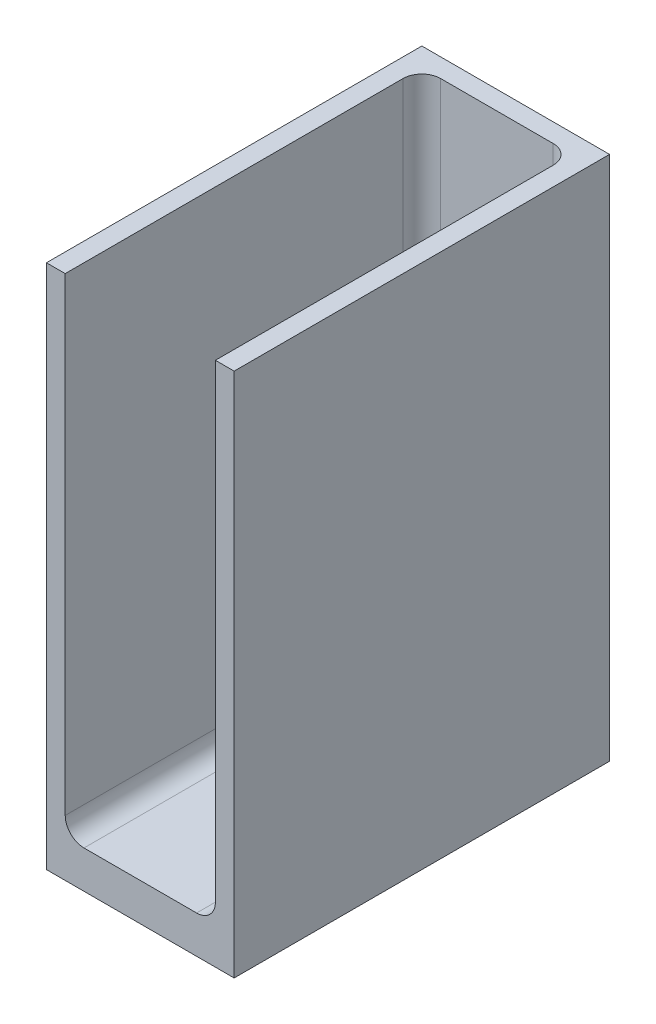
ISO-10303-21;
HEADER;
FILE_DESCRIPTION(('STEP AP214'),'2;1');
FILE_NAME('part.step','',(''),(''),'','','');
FILE_SCHEMA(('AUTOMOTIVE_DESIGN { 1 0 10303 214 1 1 1 1 }'));
ENDSEC;
DATA;
#1=APPLICATION_CONTEXT('core data for automotive mechanical design processes');
#2=APPLICATION_PROTOCOL_DEFINITION('international standard','automotive_design',2000,#1);
#3=PRODUCT_CONTEXT('',#1,'mechanical');
#4=PRODUCT('Part','Part','',(#3));
#5=PRODUCT_RELATED_PRODUCT_CATEGORY('part','',(#4));
#6=PRODUCT_DEFINITION_FORMATION('','',#4);
#7=PRODUCT_DEFINITION_CONTEXT('part definition',#1,'design');
#8=PRODUCT_DEFINITION('design','',#6,#7);
#9=PRODUCT_DEFINITION_SHAPE('','',#8);
#10=(LENGTH_UNIT() NAMED_UNIT(*) SI_UNIT(.MILLI.,.METRE.));
#11=(NAMED_UNIT(*) PLANE_ANGLE_UNIT() SI_UNIT($,.RADIAN.));
#12=(NAMED_UNIT(*) SI_UNIT($,.STERADIAN.) SOLID_ANGLE_UNIT());
#13=UNCERTAINTY_MEASURE_WITH_UNIT(LENGTH_MEASURE(1.E-05),#10,'distance_accuracy_value','');
#14=(GEOMETRIC_REPRESENTATION_CONTEXT(3) GLOBAL_UNCERTAINTY_ASSIGNED_CONTEXT((#13)) GLOBAL_UNIT_ASSIGNED_CONTEXT((#10,
#11,#12)) REPRESENTATION_CONTEXT('',''));
#15=CARTESIAN_POINT('',(0.,0.,0.));
#16=DIRECTION('',(0.,0.,1.));
#17=DIRECTION('',(1.,0.,0.));
#18=AXIS2_PLACEMENT_3D('',#15,#16,#17);
#19=CARTESIAN_POINT('',(0.,5.08,0.));
#20=DIRECTION('',(0.,-1.,0.));
#21=DIRECTION('',(0.,0.,-1.));
#22=AXIS2_PLACEMENT_3D('',#19,#20,#21);
#23=PLANE('',#22);
#24=DIRECTION('',(1.,0.,0.));
#25=VECTOR('',#24,1.);
#26=CARTESIAN_POINT('',(-12.7,5.08,25.4));
#27=LINE('',#26,#25);
#28=CARTESIAN_POINT('',(-7.62,5.08,25.4));
#29=VERTEX_POINT('',#28);
#30=CARTESIAN_POINT('',(7.62,5.08,25.4));
#31=VERTEX_POINT('',#30);
#32=EDGE_CURVE('E161',#29,#31,#27,.T.);
#33=ORIENTED_EDGE('',*,*,#32,.T.);
#34=DIRECTION('',(0.,0.,1.));
#35=VECTOR('',#34,1.);
#36=CARTESIAN_POINT('',(7.62,5.08,-22.86));
#37=LINE('',#36,#35);
#38=CARTESIAN_POINT('',(7.62,5.08,-20.32));
#39=VERTEX_POINT('',#38);
#40=EDGE_CURVE('E59',#31,#39,#37,.F.);
#41=ORIENTED_EDGE('',*,*,#40,.T.);
#42=DIRECTION('',(1.,0.,0.));
#43=VECTOR('',#42,1.);
#44=CARTESIAN_POINT('',(-10.16,5.08,-20.32));
#45=LINE('',#44,#43);
#46=CARTESIAN_POINT('',(-7.62,5.08,-20.32));
#47=VERTEX_POINT('',#46);
#48=EDGE_CURVE('E54',#39,#47,#45,.F.);
#49=ORIENTED_EDGE('',*,*,#48,.T.);
#50=DIRECTION('',(0.,0.,-1.));
#51=VECTOR('',#50,1.);
#52=CARTESIAN_POINT('',(-7.62,5.08,25.4));
#53=LINE('',#52,#51);
#54=EDGE_CURVE('E194',#47,#29,#53,.F.);
#55=ORIENTED_EDGE('',*,*,#54,.T.);
#56=EDGE_LOOP('',(#33,#41,#49,#55));
#57=FACE_BOUND('',#56,.T.);
#58=ADVANCED_FACE('F37',(#57),#23,.F.);
#59=CARTESIAN_POINT('',(12.7,5.08,25.4));
#60=DIRECTION('',(-1.,0.,0.));
#61=DIRECTION('',(0.,0.,1.));
#62=AXIS2_PLACEMENT_3D('',#59,#60,#61);
#63=PLANE('',#62);
#64=DIRECTION('',(0.,0.,-1.));
#65=VECTOR('',#64,1.);
#66=CARTESIAN_POINT('',(12.7,0.,25.4));
#67=LINE('',#66,#65);
#68=CARTESIAN_POINT('',(12.7,0.,25.4));
#69=VERTEX_POINT('',#68);
#70=CARTESIAN_POINT('',(12.7,0.,-25.4));
#71=VERTEX_POINT('',#70);
#72=EDGE_CURVE('E151',#69,#71,#67,.T.);
#73=ORIENTED_EDGE('',*,*,#72,.T.);
#74=DIRECTION('',(0.,-1.,0.));
#75=VECTOR('',#74,1.);
#76=CARTESIAN_POINT('',(12.7,5.08,-25.4));
#77=LINE('',#76,#75);
#78=CARTESIAN_POINT('',(12.7,71.12,-25.4));
#79=VERTEX_POINT('',#78);
#80=EDGE_CURVE('E176',#79,#71,#77,.T.);
#81=ORIENTED_EDGE('',*,*,#80,.F.);
#82=DIRECTION('',(0.,0.,-1.));
#83=VECTOR('',#82,1.);
#84=CARTESIAN_POINT('',(12.7,71.12,-25.4));
#85=LINE('',#84,#83);
#86=CARTESIAN_POINT('',(12.7,71.12,25.4));
#87=VERTEX_POINT('',#86);
#88=EDGE_CURVE('E250',#87,#79,#85,.T.);
#89=ORIENTED_EDGE('',*,*,#88,.F.);
#90=DIRECTION('',(0.,-1.,0.));
#91=VECTOR('',#90,1.);
#92=CARTESIAN_POINT('',(12.7,5.08,25.4));
#93=LINE('',#92,#91);
#94=EDGE_CURVE('E162',#87,#69,#93,.T.);
#95=ORIENTED_EDGE('',*,*,#94,.T.);
#96=EDGE_LOOP('',(#73,#81,#89,#95));
#97=FACE_BOUND('',#96,.T.);
#98=ADVANCED_FACE('F267',(#97),#63,.F.);
#99=CARTESIAN_POINT('',(-12.7,5.08,-25.4));
#100=DIRECTION('',(0.,0.,1.));
#101=DIRECTION('',(1.,0.,0.));
#102=AXIS2_PLACEMENT_3D('',#99,#100,#101);
#103=PLANE('',#102);
#104=DIRECTION('',(-1.,0.,0.));
#105=VECTOR('',#104,1.);
#106=CARTESIAN_POINT('',(-12.7,0.,-25.4));
#107=LINE('',#106,#105);
#108=CARTESIAN_POINT('',(-12.7,0.,-25.4));
#109=VERTEX_POINT('',#108);
#110=EDGE_CURVE('E155',#71,#109,#107,.T.);
#111=ORIENTED_EDGE('',*,*,#110,.T.);
#112=DIRECTION('',(0.,-1.,0.));
#113=VECTOR('',#112,1.);
#114=CARTESIAN_POINT('',(-12.7,5.08,-25.4));
#115=LINE('',#114,#113);
#116=CARTESIAN_POINT('',(-12.7,71.12,-25.4));
#117=VERTEX_POINT('',#116);
#118=EDGE_CURVE('E173',#117,#109,#115,.T.);
#119=ORIENTED_EDGE('',*,*,#118,.F.);
#120=DIRECTION('',(-1.,0.,0.));
#121=VECTOR('',#120,1.);
#122=CARTESIAN_POINT('',(-12.7,71.12,-25.4));
#123=LINE('',#122,#121);
#124=EDGE_CURVE('E255',#79,#117,#123,.T.);
#125=ORIENTED_EDGE('',*,*,#124,.F.);
#126=ORIENTED_EDGE('',*,*,#80,.T.);
#127=EDGE_LOOP('',(#111,#119,#125,#126));
#128=FACE_BOUND('',#127,.T.);
#129=ADVANCED_FACE('F286',(#128),#103,.F.);
#130=CARTESIAN_POINT('',(-12.7,5.08,25.4));
#131=DIRECTION('',(1.,0.,0.));
#132=DIRECTION('',(0.,0.,-1.));
#133=AXIS2_PLACEMENT_3D('',#130,#131,#132);
#134=PLANE('',#133);
#135=DIRECTION('',(0.,0.,1.));
#136=VECTOR('',#135,1.);
#137=CARTESIAN_POINT('',(-12.7,0.,25.4));
#138=LINE('',#137,#136);
#139=CARTESIAN_POINT('',(-12.7,0.,25.4));
#140=VERTEX_POINT('',#139);
#141=EDGE_CURVE('E166',#109,#140,#138,.T.);
#142=ORIENTED_EDGE('',*,*,#141,.T.);
#143=DIRECTION('',(0.,-1.,0.));
#144=VECTOR('',#143,1.);
#145=CARTESIAN_POINT('',(-12.7,5.08,25.4));
#146=LINE('',#145,#144);
#147=CARTESIAN_POINT('',(-12.7,71.12,25.4));
#148=VERTEX_POINT('',#147);
#149=EDGE_CURVE('E171',#148,#140,#146,.T.);
#150=ORIENTED_EDGE('',*,*,#149,.F.);
#151=DIRECTION('',(0.,0.,1.));
#152=VECTOR('',#151,1.);
#153=CARTESIAN_POINT('',(-12.7,71.12,25.4));
#154=LINE('',#153,#152);
#155=EDGE_CURVE('E144',#117,#148,#154,.T.);
#156=ORIENTED_EDGE('',*,*,#155,.F.);
#157=ORIENTED_EDGE('',*,*,#118,.T.);
#158=EDGE_LOOP('',(#142,#150,#156,#157));
#159=FACE_BOUND('',#158,.T.);
#160=ADVANCED_FACE('F260',(#159),#134,.F.);
#161=CARTESIAN_POINT('',(-12.7,5.08,25.4));
#162=DIRECTION('',(0.,0.,-1.));
#163=DIRECTION('',(-1.,0.,0.));
#164=AXIS2_PLACEMENT_3D('',#161,#162,#163);
#165=PLANE('',#164);
#166=DIRECTION('',(1.,0.,0.));
#167=VECTOR('',#166,1.);
#168=CARTESIAN_POINT('',(-12.7,0.,25.4));
#169=LINE('',#168,#167);
#170=EDGE_CURVE('E163',#140,#69,#169,.T.);
#171=ORIENTED_EDGE('',*,*,#170,.T.);
#172=ORIENTED_EDGE('',*,*,#94,.F.);
#173=DIRECTION('',(1.,0.,0.));
#174=VECTOR('',#173,1.);
#175=CARTESIAN_POINT('',(12.7,71.12,25.4));
#176=LINE('',#175,#174);
#177=CARTESIAN_POINT('',(10.16,71.12,25.4));
#178=VERTEX_POINT('',#177);
#179=EDGE_CURVE('E248',#178,#87,#176,.T.);
#180=ORIENTED_EDGE('',*,*,#179,.F.);
#181=DIRECTION('',(0.,-1.,0.));
#182=VECTOR('',#181,1.);
#183=CARTESIAN_POINT('',(10.16,71.12,25.4));
#184=LINE('',#183,#182);
#185=CARTESIAN_POINT('',(10.16,7.62,25.4));
#186=VERTEX_POINT('',#185);
#187=EDGE_CURVE('E152',#178,#186,#184,.T.);
#188=ORIENTED_EDGE('',*,*,#187,.T.);
#189=CARTESIAN_POINT('',(7.62,7.62,25.4));
#190=DIRECTION('',(0.,0.,-1.));
#191=DIRECTION('',(-1.,0.,0.));
#192=AXIS2_PLACEMENT_3D('',#189,#190,#191);
#193=CIRCLE('',#192,2.54);
#194=EDGE_CURVE('E46',#186,#31,#193,.T.);
#195=ORIENTED_EDGE('',*,*,#194,.T.);
#196=ORIENTED_EDGE('',*,*,#32,.F.);
#197=CARTESIAN_POINT('',(-7.62,7.62,25.4));
#198=DIRECTION('',(0.,0.,-1.));
#199=DIRECTION('',(-1.,0.,0.));
#200=AXIS2_PLACEMENT_3D('',#197,#198,#199);
#201=CIRCLE('',#200,2.54);
#202=CARTESIAN_POINT('',(-10.16,7.62,25.4));
#203=VERTEX_POINT('',#202);
#204=EDGE_CURVE('E11',#29,#203,#201,.T.);
#205=ORIENTED_EDGE('',*,*,#204,.T.);
#206=DIRECTION('',(0.,-1.,0.));
#207=VECTOR('',#206,1.);
#208=CARTESIAN_POINT('',(-10.16,71.12,25.4));
#209=LINE('',#208,#207);
#210=CARTESIAN_POINT('',(-10.16,71.12,25.4));
#211=VERTEX_POINT('',#210);
#212=EDGE_CURVE('E130',#211,#203,#209,.T.);
#213=ORIENTED_EDGE('',*,*,#212,.F.);
#214=DIRECTION('',(1.,0.,0.));
#215=VECTOR('',#214,1.);
#216=CARTESIAN_POINT('',(-10.16,71.12,25.4));
#217=LINE('',#216,#215);
#218=EDGE_CURVE('E137',#148,#211,#217,.T.);
#219=ORIENTED_EDGE('',*,*,#218,.F.);
#220=ORIENTED_EDGE('',*,*,#149,.T.);
#221=EDGE_LOOP('',(#171,#172,#180,#188,#195,#196,#205,#213,#219,#220));
#222=FACE_BOUND('',#221,.T.);
#223=ADVANCED_FACE('F148',(#222),#165,.F.);
#224=CARTESIAN_POINT('',(0.,0.,0.));
#225=DIRECTION('',(0.,-1.,0.));
#226=DIRECTION('',(0.,0.,-1.));
#227=AXIS2_PLACEMENT_3D('',#224,#225,#226);
#228=PLANE('',#227);
#229=ORIENTED_EDGE('',*,*,#72,.F.);
#230=ORIENTED_EDGE('',*,*,#170,.F.);
#231=ORIENTED_EDGE('',*,*,#141,.F.);
#232=ORIENTED_EDGE('',*,*,#110,.F.);
#233=EDGE_LOOP('',(#229,#230,#231,#232));
#234=FACE_BOUND('',#233,.T.);
#235=ADVANCED_FACE('F265',(#234),#228,.T.);
#236=CARTESIAN_POINT('',(-10.16,71.12,-22.86));
#237=DIRECTION('',(-1.,0.,0.));
#238=DIRECTION('',(0.,0.,1.));
#239=AXIS2_PLACEMENT_3D('',#236,#237,#238);
#240=PLANE('',#239);
#241=DIRECTION('',(0.,0.,-1.));
#242=VECTOR('',#241,1.);
#243=CARTESIAN_POINT('',(-10.16,7.62,-22.86));
#244=LINE('',#243,#242);
#245=CARTESIAN_POINT('',(-10.16,7.62,-20.32));
#246=VERTEX_POINT('',#245);
#247=EDGE_CURVE('E190',#203,#246,#244,.T.);
#248=ORIENTED_EDGE('',*,*,#247,.T.);
#249=DIRECTION('',(0.,-1.,0.));
#250=VECTOR('',#249,1.);
#251=CARTESIAN_POINT('',(-10.16,71.12,-20.32));
#252=LINE('',#251,#250);
#253=CARTESIAN_POINT('',(-10.16,71.12,-20.32));
#254=VERTEX_POINT('',#253);
#255=EDGE_CURVE('E133',#246,#254,#252,.F.);
#256=ORIENTED_EDGE('',*,*,#255,.T.);
#257=DIRECTION('',(0.,0.,-1.));
#258=VECTOR('',#257,1.);
#259=CARTESIAN_POINT('',(-10.16,71.12,-22.86));
#260=LINE('',#259,#258);
#261=EDGE_CURVE('E126',#211,#254,#260,.T.);
#262=ORIENTED_EDGE('',*,*,#261,.F.);
#263=ORIENTED_EDGE('',*,*,#212,.T.);
#264=EDGE_LOOP('',(#248,#256,#262,#263));
#265=FACE_BOUND('',#264,.T.);
#266=ADVANCED_FACE('F128',(#265),#240,.F.);
#267=CARTESIAN_POINT('',(10.16,71.12,-22.86));
#268=DIRECTION('',(0.,0.,-1.));
#269=DIRECTION('',(-1.,0.,0.));
#270=AXIS2_PLACEMENT_3D('',#267,#268,#269);
#271=PLANE('',#270);
#272=DIRECTION('',(1.,0.,0.));
#273=VECTOR('',#272,1.);
#274=CARTESIAN_POINT('',(10.16,7.62,-22.86));
#275=LINE('',#274,#273);
#276=CARTESIAN_POINT('',(-7.62,7.62,-22.86));
#277=VERTEX_POINT('',#276);
#278=CARTESIAN_POINT('',(7.62,7.62,-22.86));
#279=VERTEX_POINT('',#278);
#280=EDGE_CURVE('E184',#277,#279,#275,.T.);
#281=ORIENTED_EDGE('',*,*,#280,.T.);
#282=DIRECTION('',(0.,-1.,0.));
#283=VECTOR('',#282,1.);
#284=CARTESIAN_POINT('',(7.62,71.12,-22.86));
#285=LINE('',#284,#283);
#286=CARTESIAN_POINT('',(7.62,71.12,-22.86));
#287=VERTEX_POINT('',#286);
#288=EDGE_CURVE('E188',#279,#287,#285,.F.);
#289=ORIENTED_EDGE('',*,*,#288,.T.);
#290=DIRECTION('',(1.,0.,0.));
#291=VECTOR('',#290,1.);
#292=CARTESIAN_POINT('',(10.16,71.12,-22.86));
#293=LINE('',#292,#291);
#294=CARTESIAN_POINT('',(-7.62,71.12,-22.86));
#295=VERTEX_POINT('',#294);
#296=EDGE_CURVE('E136',#295,#287,#293,.T.);
#297=ORIENTED_EDGE('',*,*,#296,.F.);
#298=DIRECTION('',(0.,-1.,0.));
#299=VECTOR('',#298,1.);
#300=CARTESIAN_POINT('',(-7.62,5.08,-22.86));
#301=LINE('',#300,#299);
#302=EDGE_CURVE('E186',#295,#277,#301,.T.);
#303=ORIENTED_EDGE('',*,*,#302,.T.);
#304=EDGE_LOOP('',(#281,#289,#297,#303));
#305=FACE_BOUND('',#304,.T.);
#306=ADVANCED_FACE('F228',(#305),#271,.F.);
#307=CARTESIAN_POINT('',(10.16,71.12,25.4));
#308=DIRECTION('',(1.,0.,0.));
#309=DIRECTION('',(0.,0.,-1.));
#310=AXIS2_PLACEMENT_3D('',#307,#308,#309);
#311=PLANE('',#310);
#312=DIRECTION('',(0.,0.,1.));
#313=VECTOR('',#312,1.);
#314=CARTESIAN_POINT('',(10.16,71.12,25.4));
#315=LINE('',#314,#313);
#316=CARTESIAN_POINT('',(10.16,71.12,-20.32));
#317=VERTEX_POINT('',#316);
#318=EDGE_CURVE('E236',#317,#178,#315,.T.);
#319=ORIENTED_EDGE('',*,*,#318,.F.);
#320=DIRECTION('',(0.,-1.,0.));
#321=VECTOR('',#320,1.);
#322=CARTESIAN_POINT('',(10.16,5.08,-20.32));
#323=LINE('',#322,#321);
#324=CARTESIAN_POINT('',(10.16,7.62,-20.32));
#325=VERTEX_POINT('',#324);
#326=EDGE_CURVE('E181',#317,#325,#323,.T.);
#327=ORIENTED_EDGE('',*,*,#326,.T.);
#328=DIRECTION('',(0.,0.,1.));
#329=VECTOR('',#328,1.);
#330=CARTESIAN_POINT('',(10.16,7.62,25.4));
#331=LINE('',#330,#329);
#332=EDGE_CURVE('E179',#325,#186,#331,.T.);
#333=ORIENTED_EDGE('',*,*,#332,.T.);
#334=ORIENTED_EDGE('',*,*,#187,.F.);
#335=EDGE_LOOP('',(#319,#327,#333,#334));
#336=FACE_BOUND('',#335,.T.);
#337=ADVANCED_FACE('F243',(#336),#311,.F.);
#338=CARTESIAN_POINT('',(0.,71.12,0.));
#339=DIRECTION('',(0.,-1.,0.));
#340=DIRECTION('',(0.,0.,-1.));
#341=AXIS2_PLACEMENT_3D('',#338,#339,#340);
#342=PLANE('',#341);
#343=ORIENTED_EDGE('',*,*,#218,.T.);
#344=ORIENTED_EDGE('',*,*,#261,.T.);
#345=CARTESIAN_POINT('',(-7.62,71.12,-20.32));
#346=DIRECTION('',(0.,-1.,0.));
#347=DIRECTION('',(0.,0.,-1.));
#348=AXIS2_PLACEMENT_3D('',#345,#346,#347);
#349=CIRCLE('',#348,2.54);
#350=EDGE_CURVE('E199',#254,#295,#349,.T.);
#351=ORIENTED_EDGE('',*,*,#350,.T.);
#352=ORIENTED_EDGE('',*,*,#296,.T.);
#353=CARTESIAN_POINT('',(7.62,71.12,-20.32));
#354=DIRECTION('',(0.,-1.,0.));
#355=DIRECTION('',(0.,0.,-1.));
#356=AXIS2_PLACEMENT_3D('',#353,#354,#355);
#357=CIRCLE('',#356,2.54);
#358=EDGE_CURVE('E197',#287,#317,#357,.T.);
#359=ORIENTED_EDGE('',*,*,#358,.T.);
#360=ORIENTED_EDGE('',*,*,#318,.T.);
#361=ORIENTED_EDGE('',*,*,#179,.T.);
#362=ORIENTED_EDGE('',*,*,#88,.T.);
#363=ORIENTED_EDGE('',*,*,#124,.T.);
#364=ORIENTED_EDGE('',*,*,#155,.T.);
#365=EDGE_LOOP('',(#343,#344,#351,#352,#359,#360,#361,#362,#363,#364));
#366=FACE_BOUND('',#365,.T.);
#367=ADVANCED_FACE('F141',(#366),#342,.F.);
#368=CARTESIAN_POINT('',(-7.62,7.62,-22.86));
#369=DIRECTION('',(0.,0.,1.));
#370=DIRECTION('',(1.,0.,0.));
#371=AXIS2_PLACEMENT_3D('',#368,#369,#370);
#372=CYLINDRICAL_SURFACE('',#371,2.54);
#373=ORIENTED_EDGE('',*,*,#204,.F.);
#374=ORIENTED_EDGE('',*,*,#54,.F.);
#375=CARTESIAN_POINT('',(-7.62,7.62,-20.32));
#376=DIRECTION('',(0.,0.,1.));
#377=DIRECTION('',(1.,0.,0.));
#378=AXIS2_PLACEMENT_3D('',#375,#376,#377);
#379=CIRCLE('',#378,2.54);
#380=EDGE_CURVE('E41',#246,#47,#379,.T.);
#381=ORIENTED_EDGE('',*,*,#380,.F.);
#382=ORIENTED_EDGE('',*,*,#247,.F.);
#383=EDGE_LOOP('',(#373,#374,#381,#382));
#384=FACE_BOUND('',#383,.T.);
#385=ADVANCED_FACE('F39',(#384),#372,.F.);
#386=CARTESIAN_POINT('',(-7.62,71.12,-20.32));
#387=DIRECTION('',(0.,1.,0.));
#388=DIRECTION('',(0.,0.,1.));
#389=AXIS2_PLACEMENT_3D('',#386,#387,#388);
#390=CYLINDRICAL_SURFACE('',#389,2.54);
#391=ORIENTED_EDGE('',*,*,#350,.F.);
#392=ORIENTED_EDGE('',*,*,#255,.F.);
#393=CARTESIAN_POINT('',(-7.62,7.62,-20.32));
#394=DIRECTION('',(0.,1.,0.));
#395=DIRECTION('',(0.,0.,1.));
#396=AXIS2_PLACEMENT_3D('',#393,#394,#395);
#397=CIRCLE('',#396,2.54);
#398=EDGE_CURVE('E212',#277,#246,#397,.T.);
#399=ORIENTED_EDGE('',*,*,#398,.F.);
#400=ORIENTED_EDGE('',*,*,#302,.F.);
#401=EDGE_LOOP('',(#391,#392,#399,#400));
#402=FACE_BOUND('',#401,.T.);
#403=ADVANCED_FACE('F233',(#402),#390,.F.);
#404=CARTESIAN_POINT('',(-7.62,7.62,-20.32));
#405=DIRECTION('',(-1.,0.,0.));
#406=DIRECTION('',(0.,-1.,0.));
#407=AXIS2_PLACEMENT_3D('',#404,#405,#406);
#408=SPHERICAL_SURFACE('',#407,2.54);
#409=ORIENTED_EDGE('',*,*,#398,.T.);
#410=ORIENTED_EDGE('',*,*,#380,.T.);
#411=CARTESIAN_POINT('',(-7.62,7.62,-20.32));
#412=DIRECTION('',(1.,0.,0.));
#413=DIRECTION('',(0.,0.,-1.));
#414=AXIS2_PLACEMENT_3D('',#411,#412,#413);
#415=CIRCLE('',#414,2.54);
#416=EDGE_CURVE('E210',#277,#47,#415,.F.);
#417=ORIENTED_EDGE('',*,*,#416,.F.);
#418=EDGE_LOOP('',(#409,#410,#417));
#419=FACE_BOUND('',#418,.T.);
#420=ADVANCED_FACE('F219',(#419),#408,.F.);
#421=CARTESIAN_POINT('',(7.62,7.62,25.4));
#422=DIRECTION('',(0.,0.,-1.));
#423=DIRECTION('',(-1.,0.,0.));
#424=AXIS2_PLACEMENT_3D('',#421,#422,#423);
#425=CYLINDRICAL_SURFACE('',#424,2.54);
#426=ORIENTED_EDGE('',*,*,#194,.F.);
#427=ORIENTED_EDGE('',*,*,#332,.F.);
#428=CARTESIAN_POINT('',(7.62,7.62,-20.32));
#429=DIRECTION('',(0.,0.,1.));
#430=DIRECTION('',(1.,0.,0.));
#431=AXIS2_PLACEMENT_3D('',#428,#429,#430);
#432=CIRCLE('',#431,2.54);
#433=EDGE_CURVE('E207',#39,#325,#432,.T.);
#434=ORIENTED_EDGE('',*,*,#433,.F.);
#435=ORIENTED_EDGE('',*,*,#40,.F.);
#436=EDGE_LOOP('',(#426,#427,#434,#435));
#437=FACE_BOUND('',#436,.T.);
#438=ADVANCED_FACE('F270',(#437),#425,.F.);
#439=CARTESIAN_POINT('',(10.16,7.62,-20.32));
#440=DIRECTION('',(-1.,0.,0.));
#441=DIRECTION('',(0.,0.,1.));
#442=AXIS2_PLACEMENT_3D('',#439,#440,#441);
#443=CYLINDRICAL_SURFACE('',#442,2.54);
#444=ORIENTED_EDGE('',*,*,#416,.T.);
#445=ORIENTED_EDGE('',*,*,#48,.F.);
#446=CARTESIAN_POINT('',(7.62,7.62,-20.32));
#447=DIRECTION('',(-1.,0.,0.));
#448=DIRECTION('',(0.,0.,1.));
#449=AXIS2_PLACEMENT_3D('',#446,#447,#448);
#450=CIRCLE('',#449,2.54);
#451=EDGE_CURVE('E204',#279,#39,#450,.T.);
#452=ORIENTED_EDGE('',*,*,#451,.F.);
#453=ORIENTED_EDGE('',*,*,#280,.F.);
#454=EDGE_LOOP('',(#444,#445,#452,#453));
#455=FACE_BOUND('',#454,.T.);
#456=ADVANCED_FACE('F223',(#455),#443,.F.);
#457=CARTESIAN_POINT('',(7.62,7.62,-20.32));
#458=DIRECTION('',(0.,-1.,0.));
#459=DIRECTION('',(0.,0.,-1.));
#460=AXIS2_PLACEMENT_3D('',#457,#458,#459);
#461=SPHERICAL_SURFACE('',#460,2.54);
#462=ORIENTED_EDGE('',*,*,#451,.T.);
#463=ORIENTED_EDGE('',*,*,#433,.T.);
#464=CARTESIAN_POINT('',(7.62,7.62,-20.32));
#465=DIRECTION('',(0.,1.,0.));
#466=DIRECTION('',(0.,0.,1.));
#467=AXIS2_PLACEMENT_3D('',#464,#465,#466);
#468=CIRCLE('',#467,2.54);
#469=EDGE_CURVE('E202',#279,#325,#468,.F.);
#470=ORIENTED_EDGE('',*,*,#469,.F.);
#471=EDGE_LOOP('',(#462,#463,#470));
#472=FACE_BOUND('',#471,.T.);
#473=ADVANCED_FACE('F272',(#472),#461,.F.);
#474=CARTESIAN_POINT('',(7.62,71.12,-20.32));
#475=DIRECTION('',(0.,1.,0.));
#476=DIRECTION('',(0.,0.,1.));
#477=AXIS2_PLACEMENT_3D('',#474,#475,#476);
#478=CYLINDRICAL_SURFACE('',#477,2.54);
#479=ORIENTED_EDGE('',*,*,#358,.F.);
#480=ORIENTED_EDGE('',*,*,#288,.F.);
#481=ORIENTED_EDGE('',*,*,#469,.T.);
#482=ORIENTED_EDGE('',*,*,#326,.F.);
#483=EDGE_LOOP('',(#479,#480,#481,#482));
#484=FACE_BOUND('',#483,.T.);
#485=ADVANCED_FACE('F240',(#484),#478,.F.);
#486=CLOSED_SHELL('',(#58,#98,#129,#160,#223,#235,#266,#306,#337,#367,#385,#403,#420,#438,#456,
#473,#485));
#487=MANIFOLD_SOLID_BREP('B2',#486);
#488=ADVANCED_BREP_SHAPE_REPRESENTATION('',(#18,#487),#14);
#489=SHAPE_DEFINITION_REPRESENTATION(#9,#488);
ENDSEC;
END-ISO-10303-21;
